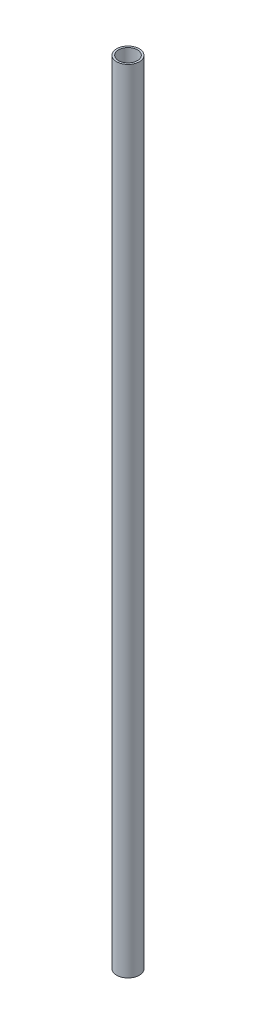
ISO-10303-21;
HEADER;
FILE_DESCRIPTION(('STEP AP214'),'2;1');
FILE_NAME('part.step','',(''),(''),'','','');
FILE_SCHEMA(('AUTOMOTIVE_DESIGN { 1 0 10303 214 1 1 1 1 }'));
ENDSEC;
DATA;
#1=APPLICATION_CONTEXT('core data for automotive mechanical design processes');
#2=APPLICATION_PROTOCOL_DEFINITION('international standard','automotive_design',2000,#1);
#3=PRODUCT_CONTEXT('',#1,'mechanical');
#4=PRODUCT('Part','Part','',(#3));
#5=PRODUCT_RELATED_PRODUCT_CATEGORY('part','',(#4));
#6=PRODUCT_DEFINITION_FORMATION('','',#4);
#7=PRODUCT_DEFINITION_CONTEXT('part definition',#1,'design');
#8=PRODUCT_DEFINITION('design','',#6,#7);
#9=PRODUCT_DEFINITION_SHAPE('','',#8);
#10=(LENGTH_UNIT() NAMED_UNIT(*) SI_UNIT(.MILLI.,.METRE.));
#11=(NAMED_UNIT(*) PLANE_ANGLE_UNIT() SI_UNIT($,.RADIAN.));
#12=(NAMED_UNIT(*) SI_UNIT($,.STERADIAN.) SOLID_ANGLE_UNIT());
#13=UNCERTAINTY_MEASURE_WITH_UNIT(LENGTH_MEASURE(1.E-05),#10,'distance_accuracy_value','');
#14=(GEOMETRIC_REPRESENTATION_CONTEXT(3) GLOBAL_UNCERTAINTY_ASSIGNED_CONTEXT((#13)) GLOBAL_UNIT_ASSIGNED_CONTEXT((#10,
#11,#12)) REPRESENTATION_CONTEXT('',''));
#15=CARTESIAN_POINT('',(0.,0.,0.));
#16=DIRECTION('',(0.,0.,1.));
#17=DIRECTION('',(1.,0.,0.));
#18=AXIS2_PLACEMENT_3D('',#15,#16,#17);
#19=CARTESIAN_POINT('',(0.,420.,0.));
#20=DIRECTION('',(0.,1.,0.));
#21=DIRECTION('',(0.,0.,1.));
#22=AXIS2_PLACEMENT_3D('',#19,#20,#21);
#23=PLANE('',#22);
#24=CARTESIAN_POINT('',(0.,420.,0.));
#25=DIRECTION('',(0.,1.,0.));
#26=DIRECTION('',(0.,0.,1.));
#27=AXIS2_PLACEMENT_3D('',#24,#25,#26);
#28=CIRCLE('',#27,6.);
#29=CARTESIAN_POINT('',(0.,420.,6.));
#30=VERTEX_POINT('',#29);
#31=EDGE_CURVE('E10',#30,#30,#28,.T.);
#32=ORIENTED_EDGE('',*,*,#31,.T.);
#33=EDGE_LOOP('',(#32));
#34=FACE_BOUND('',#33,.T.);
#35=CARTESIAN_POINT('',(0.,420.,0.));
#36=DIRECTION('',(0.,1.,0.));
#37=DIRECTION('',(0.,0.,1.));
#38=AXIS2_PLACEMENT_3D('',#35,#36,#37);
#39=CIRCLE('',#38,5.);
#40=CARTESIAN_POINT('',(0.,420.,5.));
#41=VERTEX_POINT('',#40);
#42=EDGE_CURVE('E44',#41,#41,#39,.T.);
#43=ORIENTED_EDGE('',*,*,#42,.F.);
#44=EDGE_LOOP('',(#43));
#45=FACE_BOUND('',#44,.T.);
#46=ADVANCED_FACE('F33',(#34,#45),#23,.T.);
#47=CARTESIAN_POINT('',(0.,0.,0.));
#48=DIRECTION('',(0.,1.,0.));
#49=DIRECTION('',(0.,0.,1.));
#50=AXIS2_PLACEMENT_3D('',#47,#48,#49);
#51=PLANE('',#50);
#52=CARTESIAN_POINT('',(0.,0.,0.));
#53=DIRECTION('',(0.,1.,0.));
#54=DIRECTION('',(0.,0.,1.));
#55=AXIS2_PLACEMENT_3D('',#52,#53,#54);
#56=CIRCLE('',#55,6.);
#57=CARTESIAN_POINT('',(0.,0.,6.));
#58=VERTEX_POINT('',#57);
#59=EDGE_CURVE('E37',#58,#58,#56,.T.);
#60=ORIENTED_EDGE('',*,*,#59,.F.);
#61=EDGE_LOOP('',(#60));
#62=FACE_BOUND('',#61,.T.);
#63=CARTESIAN_POINT('',(0.,0.,0.));
#64=DIRECTION('',(0.,1.,0.));
#65=DIRECTION('',(0.,0.,1.));
#66=AXIS2_PLACEMENT_3D('',#63,#64,#65);
#67=CIRCLE('',#66,5.);
#68=CARTESIAN_POINT('',(0.,0.,5.));
#69=VERTEX_POINT('',#68);
#70=EDGE_CURVE('E46',#69,#69,#67,.T.);
#71=ORIENTED_EDGE('',*,*,#70,.T.);
#72=EDGE_LOOP('',(#71));
#73=FACE_BOUND('',#72,.T.);
#74=ADVANCED_FACE('F56',(#62,#73),#51,.F.);
#75=CARTESIAN_POINT('',(0.,420.,0.));
#76=DIRECTION('',(0.,-1.,0.));
#77=DIRECTION('',(0.,0.,-1.));
#78=AXIS2_PLACEMENT_3D('',#75,#76,#77);
#79=CYLINDRICAL_SURFACE('',#78,6.);
#80=ORIENTED_EDGE('',*,*,#31,.F.);
#81=EDGE_LOOP('',(#80));
#82=FACE_BOUND('',#81,.T.);
#83=ORIENTED_EDGE('',*,*,#59,.T.);
#84=EDGE_LOOP('',(#83));
#85=FACE_BOUND('',#84,.T.);
#86=ADVANCED_FACE('F35',(#82,#85),#79,.T.);
#87=CARTESIAN_POINT('',(0.,420.,0.));
#88=DIRECTION('',(0.,-1.,0.));
#89=DIRECTION('',(0.,0.,-1.));
#90=AXIS2_PLACEMENT_3D('',#87,#88,#89);
#91=CYLINDRICAL_SURFACE('',#90,5.);
#92=ORIENTED_EDGE('',*,*,#42,.T.);
#93=EDGE_LOOP('',(#92));
#94=FACE_BOUND('',#93,.T.);
#95=ORIENTED_EDGE('',*,*,#70,.F.);
#96=EDGE_LOOP('',(#95));
#97=FACE_BOUND('',#96,.T.);
#98=ADVANCED_FACE('F52',(#94,#97),#91,.F.);
#99=CLOSED_SHELL('',(#46,#74,#86,#98));
#100=MANIFOLD_SOLID_BREP('B2',#99);
#101=ADVANCED_BREP_SHAPE_REPRESENTATION('',(#18,#100),#14);
#102=SHAPE_DEFINITION_REPRESENTATION(#9,#101);
ENDSEC;
END-ISO-10303-21;
